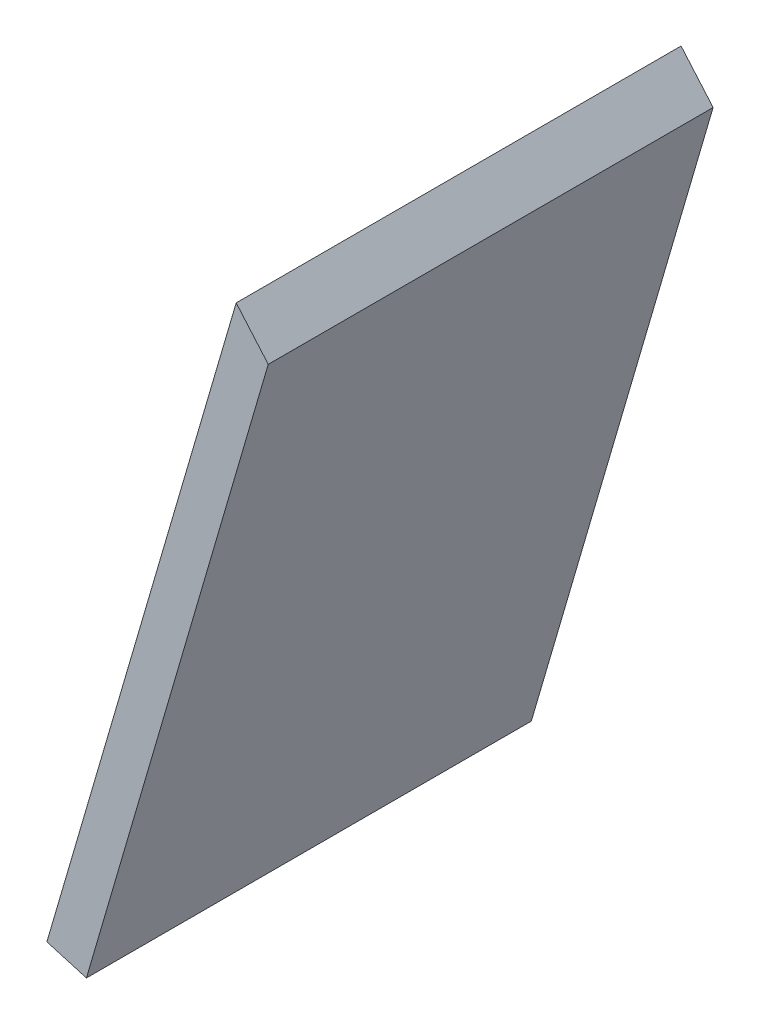
ISO-10303-21;
HEADER;
FILE_DESCRIPTION(('STEP AP214'),'2;1');
FILE_NAME('part.step','',(''),(''),'','','');
FILE_SCHEMA(('AUTOMOTIVE_DESIGN { 1 0 10303 214 1 1 1 1 }'));
ENDSEC;
DATA;
#1=APPLICATION_CONTEXT('core data for automotive mechanical design processes');
#2=APPLICATION_PROTOCOL_DEFINITION('international standard','automotive_design',2000,#1);
#3=PRODUCT_CONTEXT('',#1,'mechanical');
#4=PRODUCT('Part','Part','',(#3));
#5=PRODUCT_RELATED_PRODUCT_CATEGORY('part','',(#4));
#6=PRODUCT_DEFINITION_FORMATION('','',#4);
#7=PRODUCT_DEFINITION_CONTEXT('part definition',#1,'design');
#8=PRODUCT_DEFINITION('design','',#6,#7);
#9=PRODUCT_DEFINITION_SHAPE('','',#8);
#10=(LENGTH_UNIT() NAMED_UNIT(*) SI_UNIT(.MILLI.,.METRE.));
#11=(NAMED_UNIT(*) PLANE_ANGLE_UNIT() SI_UNIT($,.RADIAN.));
#12=(NAMED_UNIT(*) SI_UNIT($,.STERADIAN.) SOLID_ANGLE_UNIT());
#13=UNCERTAINTY_MEASURE_WITH_UNIT(LENGTH_MEASURE(1.E-05),#10,'distance_accuracy_value','');
#14=(GEOMETRIC_REPRESENTATION_CONTEXT(3) GLOBAL_UNCERTAINTY_ASSIGNED_CONTEXT((#13)) GLOBAL_UNIT_ASSIGNED_CONTEXT((#10,
#11,#12)) REPRESENTATION_CONTEXT('',''));
#15=CARTESIAN_POINT('',(0.,0.,0.));
#16=DIRECTION('',(0.,0.,1.));
#17=DIRECTION('',(1.,0.,0.));
#18=AXIS2_PLACEMENT_3D('',#15,#16,#17);
#19=CARTESIAN_POINT('',(-272.519046524245,-127.125849595512,830.851547809768));
#20=DIRECTION('',(0.959881543544021,-0.280405817278364,0.));
#21=DIRECTION('',(0.280405817278364,0.959881543544021,0.));
#22=AXIS2_PLACEMENT_3D('',#19,#20,#21);
#23=PLANE('',#22);
#24=DIRECTION('',(0.280405817278364,0.959881543544021,0.));
#25=VECTOR('',#24,1.);
#26=CARTESIAN_POINT('',(-272.519046524245,-127.125849595511,568.202285509174));
#27=LINE('',#26,#25);
#28=CARTESIAN_POINT('',(-295.490832863216,-205.762569557443,568.202285509174));
#29=VERTEX_POINT('',#28);
#30=CARTESIAN_POINT('',(-272.519046524245,-127.125849595512,568.202285509174));
#31=VERTEX_POINT('',#30);
#32=EDGE_CURVE('E73',#29,#31,#27,.T.);
#33=ORIENTED_EDGE('',*,*,#32,.F.);
#34=DIRECTION('',(0.,0.,1.));
#35=VECTOR('',#34,1.);
#36=CARTESIAN_POINT('',(-295.490832863216,-205.762569557443,830.851547809768));
#37=LINE('',#36,#35);
#38=CARTESIAN_POINT('',(-295.490832863216,-205.762569557443,622.18811858427));
#39=VERTEX_POINT('',#38);
#40=EDGE_CURVE('E79',#29,#39,#37,.T.);
#41=ORIENTED_EDGE('',*,*,#40,.T.);
#42=DIRECTION('',(-0.280405817278364,-0.959881543544021,0.));
#43=VECTOR('',#42,1.);
#44=CARTESIAN_POINT('',(-272.519046524245,-127.125849595512,622.18811858427));
#45=LINE('',#44,#43);
#46=CARTESIAN_POINT('',(-272.519046524245,-127.125849595512,622.18811858427));
#47=VERTEX_POINT('',#46);
#48=EDGE_CURVE('E93',#47,#39,#45,.T.);
#49=ORIENTED_EDGE('',*,*,#48,.F.);
#50=DIRECTION('',(0.,0.,-1.));
#51=VECTOR('',#50,1.);
#52=CARTESIAN_POINT('',(-272.519046524245,-127.125849595512,830.851547809768));
#53=LINE('',#52,#51);
#54=EDGE_CURVE('E80',#47,#31,#53,.T.);
#55=ORIENTED_EDGE('',*,*,#54,.T.);
#56=EDGE_LOOP('',(#33,#41,#49,#55));
#57=FACE_BOUND('',#56,.T.);
#58=ADVANCED_FACE('F33',(#57),#23,.F.);
#59=CARTESIAN_POINT('',(-268.630033513806,-131.64432999287,830.851547809768));
#60=DIRECTION('',(-0.959881543544021,0.280405817278364,0.));
#61=DIRECTION('',(-0.280405817278364,-0.959881543544021,0.));
#62=AXIS2_PLACEMENT_3D('',#59,#60,#61);
#63=PLANE('',#62);
#64=DIRECTION('',(-0.280405817278364,-0.959881543544021,0.));
#65=VECTOR('',#64,1.);
#66=CARTESIAN_POINT('',(-268.630033513806,-131.64432999287,568.202285509174));
#67=LINE('',#66,#65);
#68=CARTESIAN_POINT('',(-268.630033513806,-131.64432999287,568.202285509174));
#69=VERTEX_POINT('',#68);
#70=CARTESIAN_POINT('',(-290.691425145496,-207.164598643835,568.202285509174));
#71=VERTEX_POINT('',#70);
#72=EDGE_CURVE('E47',#69,#71,#67,.T.);
#73=ORIENTED_EDGE('',*,*,#72,.F.);
#74=DIRECTION('',(0.,0.,-1.));
#75=VECTOR('',#74,1.);
#76=CARTESIAN_POINT('',(-268.630033513806,-131.64432999287,830.851547809768));
#77=LINE('',#76,#75);
#78=CARTESIAN_POINT('',(-268.630033513806,-131.64432999287,622.18811858427));
#79=VERTEX_POINT('',#78);
#80=EDGE_CURVE('E86',#79,#69,#77,.T.);
#81=ORIENTED_EDGE('',*,*,#80,.F.);
#82=DIRECTION('',(0.280405817278364,0.959881543544021,0.));
#83=VECTOR('',#82,1.);
#84=CARTESIAN_POINT('',(-268.630033513806,-131.64432999287,622.18811858427));
#85=LINE('',#84,#83);
#86=CARTESIAN_POINT('',(-290.691425145496,-207.164598643835,622.18811858427));
#87=VERTEX_POINT('',#86);
#88=EDGE_CURVE('E91',#87,#79,#85,.T.);
#89=ORIENTED_EDGE('',*,*,#88,.F.);
#90=DIRECTION('',(0.,0.,1.));
#91=VECTOR('',#90,1.);
#92=CARTESIAN_POINT('',(-290.691425145496,-207.164598643835,413.892285509237));
#93=LINE('',#92,#91);
#94=EDGE_CURVE('E54',#71,#87,#93,.T.);
#95=ORIENTED_EDGE('',*,*,#94,.F.);
#96=EDGE_LOOP('',(#73,#81,#89,#95));
#97=FACE_BOUND('',#96,.T.);
#98=ADVANCED_FACE('F105',(#97),#63,.F.);
#99=CARTESIAN_POINT('',(-272.519046524245,-127.125849595512,830.851547809768));
#100=DIRECTION('',(-0.757926422579715,-0.652340047793722,0.));
#101=DIRECTION('',(0.652340047793722,-0.757926422579715,0.));
#102=AXIS2_PLACEMENT_3D('',#99,#100,#101);
#103=PLANE('',#102);
#104=DIRECTION('',(0.652340047793722,-0.757926422579715,0.));
#105=VECTOR('',#104,1.);
#106=CARTESIAN_POINT('',(-272.519046524245,-127.125849595512,568.202285509174));
#107=LINE('',#106,#105);
#108=EDGE_CURVE('E81',#31,#69,#107,.T.);
#109=ORIENTED_EDGE('',*,*,#108,.F.);
#110=ORIENTED_EDGE('',*,*,#54,.F.);
#111=DIRECTION('',(-0.652340047793722,0.757926422579715,0.));
#112=VECTOR('',#111,1.);
#113=CARTESIAN_POINT('',(-272.519046524245,-127.125849595512,622.18811858427));
#114=LINE('',#113,#112);
#115=EDGE_CURVE('E95',#79,#47,#114,.T.);
#116=ORIENTED_EDGE('',*,*,#115,.F.);
#117=ORIENTED_EDGE('',*,*,#80,.T.);
#118=EDGE_LOOP('',(#109,#110,#116,#117));
#119=FACE_BOUND('',#118,.T.);
#120=ADVANCED_FACE('F102',(#119),#103,.F.);
#121=CARTESIAN_POINT('',(-309.889056016377,-201.556482298268,413.892285509237));
#122=DIRECTION('',(0.280405817278364,0.959881543544021,0.));
#123=DIRECTION('',(-0.959881543544021,0.280405817278364,0.));
#124=AXIS2_PLACEMENT_3D('',#121,#122,#123);
#125=PLANE('',#124);
#126=DIRECTION('',(-0.959881543544021,0.280405817278364,0.));
#127=VECTOR('',#126,1.);
#128=CARTESIAN_POINT('',(-309.889056016377,-201.556482298268,568.202285509174));
#129=LINE('',#128,#127);
#130=EDGE_CURVE('E11',#71,#29,#129,.T.);
#131=ORIENTED_EDGE('',*,*,#130,.F.);
#132=ORIENTED_EDGE('',*,*,#94,.T.);
#133=DIRECTION('',(-0.959881543544021,0.280405817278364,0.));
#134=VECTOR('',#133,1.);
#135=CARTESIAN_POINT('',(-354.746371429165,-188.45251934176,622.18811858427));
#136=LINE('',#135,#134);
#137=EDGE_CURVE('E41',#87,#39,#136,.T.);
#138=ORIENTED_EDGE('',*,*,#137,.T.);
#139=ORIENTED_EDGE('',*,*,#40,.F.);
#140=EDGE_LOOP('',(#131,#132,#138,#139));
#141=FACE_BOUND('',#140,.T.);
#142=ADVANCED_FACE('F83',(#141),#125,.F.);
#143=CARTESIAN_POINT('',(-356.22352854343,-193.50910434652,622.18811858427));
#144=DIRECTION('',(0.,0.,1.));
#145=DIRECTION('',(0.360289784603418,-0.932840431751552,0.));
#146=AXIS2_PLACEMENT_3D('',#143,#144,#145);
#147=PLANE('',#146);
#148=ORIENTED_EDGE('',*,*,#137,.F.);
#149=ORIENTED_EDGE('',*,*,#88,.T.);
#150=ORIENTED_EDGE('',*,*,#115,.T.);
#151=ORIENTED_EDGE('',*,*,#48,.T.);
#152=EDGE_LOOP('',(#148,#149,#150,#151));
#153=FACE_BOUND('',#152,.T.);
#154=ADVANCED_FACE('F35',(#153),#147,.T.);
#155=CARTESIAN_POINT('',(-268.126479955696,-164.060077584524,568.202285509174));
#156=DIRECTION('',(0.,0.,-1.));
#157=DIRECTION('',(0.,1.,0.));
#158=AXIS2_PLACEMENT_3D('',#155,#156,#157);
#159=PLANE('',#158);
#160=ORIENTED_EDGE('',*,*,#108,.T.);
#161=ORIENTED_EDGE('',*,*,#72,.T.);
#162=ORIENTED_EDGE('',*,*,#130,.T.);
#163=ORIENTED_EDGE('',*,*,#32,.T.);
#164=EDGE_LOOP('',(#160,#161,#162,#163));
#165=FACE_BOUND('',#164,.T.);
#166=ADVANCED_FACE('F72',(#165),#159,.T.);
#167=CLOSED_SHELL('',(#58,#98,#120,#142,#154,#166));
#168=MANIFOLD_SOLID_BREP('B2',#167);
#169=ADVANCED_BREP_SHAPE_REPRESENTATION('',(#18,#168),#14);
#170=SHAPE_DEFINITION_REPRESENTATION(#9,#169);
ENDSEC;
END-ISO-10303-21;
